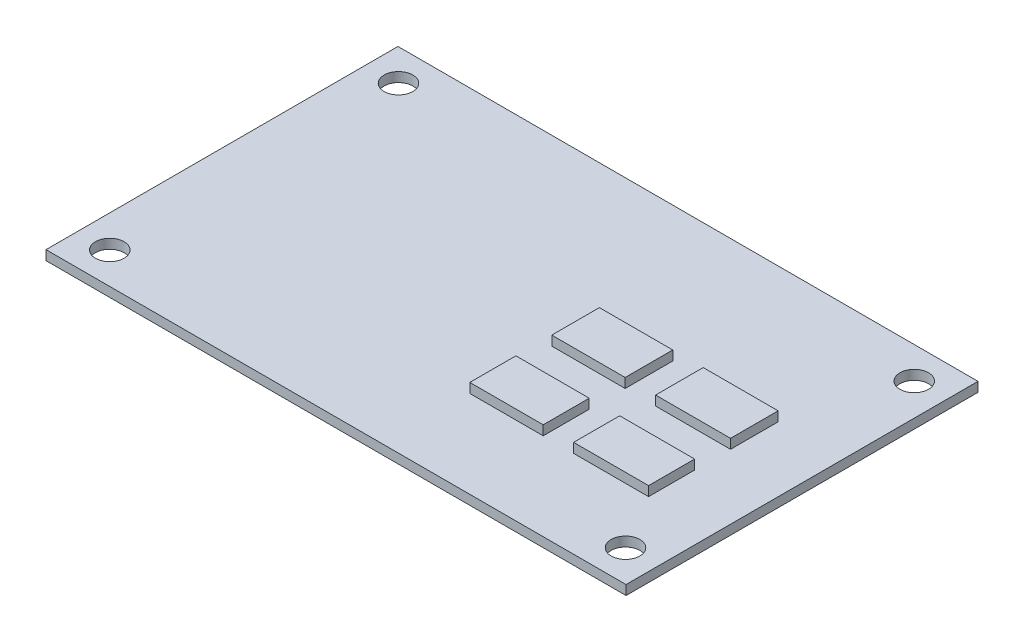
ISO-10303-21;
HEADER;
FILE_DESCRIPTION(('STEP AP214'),'2;1');
FILE_NAME('part.step','',(''),(''),'','','');
FILE_SCHEMA(('AUTOMOTIVE_DESIGN { 1 0 10303 214 1 1 1 1 }'));
ENDSEC;
DATA;
#1=APPLICATION_CONTEXT('core data for automotive mechanical design processes');
#2=APPLICATION_PROTOCOL_DEFINITION('international standard','automotive_design',2000,#1);
#3=PRODUCT_CONTEXT('',#1,'mechanical');
#4=PRODUCT('Part','Part','',(#3));
#5=PRODUCT_RELATED_PRODUCT_CATEGORY('part','',(#4));
#6=PRODUCT_DEFINITION_FORMATION('','',#4);
#7=PRODUCT_DEFINITION_CONTEXT('part definition',#1,'design');
#8=PRODUCT_DEFINITION('design','',#6,#7);
#9=PRODUCT_DEFINITION_SHAPE('','',#8);
#10=(LENGTH_UNIT() NAMED_UNIT(*) SI_UNIT(.MILLI.,.METRE.));
#11=(NAMED_UNIT(*) PLANE_ANGLE_UNIT() SI_UNIT($,.RADIAN.));
#12=(NAMED_UNIT(*) SI_UNIT($,.STERADIAN.) SOLID_ANGLE_UNIT());
#13=UNCERTAINTY_MEASURE_WITH_UNIT(LENGTH_MEASURE(1.E-05),#10,'distance_accuracy_value','');
#14=(GEOMETRIC_REPRESENTATION_CONTEXT(3) GLOBAL_UNCERTAINTY_ASSIGNED_CONTEXT((#13)) GLOBAL_UNIT_ASSIGNED_CONTEXT((#10,
#11,#12)) REPRESENTATION_CONTEXT('',''));
#15=CARTESIAN_POINT('',(0.,0.,0.));
#16=DIRECTION('',(0.,0.,1.));
#17=DIRECTION('',(1.,0.,0.));
#18=AXIS2_PLACEMENT_3D('',#15,#16,#17);
#19=CARTESIAN_POINT('',(0.,1.,0.));
#20=DIRECTION('',(0.,1.,0.));
#21=DIRECTION('',(0.,0.,1.));
#22=AXIS2_PLACEMENT_3D('',#19,#20,#21);
#23=PLANE('',#22);
#24=CARTESIAN_POINT('',(-27.,1.,-15.115));
#25=DIRECTION('',(0.,1.,0.));
#26=DIRECTION('',(0.,0.,1.));
#27=AXIS2_PLACEMENT_3D('',#24,#25,#26);
#28=CIRCLE('',#27,1.5);
#29=CARTESIAN_POINT('',(-27.,1.,-13.615));
#30=VERTEX_POINT('',#29);
#31=EDGE_CURVE('E289',#30,#30,#28,.T.);
#32=ORIENTED_EDGE('',*,*,#31,.F.);
#33=EDGE_LOOP('',(#32));
#34=FACE_BOUND('',#33,.T.);
#35=CARTESIAN_POINT('',(27.,1.,-15.115));
#36=DIRECTION('',(0.,1.,0.));
#37=DIRECTION('',(0.,0.,1.));
#38=AXIS2_PLACEMENT_3D('',#35,#36,#37);
#39=CIRCLE('',#38,1.5);
#40=CARTESIAN_POINT('',(27.,1.,-13.615));
#41=VERTEX_POINT('',#40);
#42=EDGE_CURVE('E292',#41,#41,#39,.T.);
#43=ORIENTED_EDGE('',*,*,#42,.F.);
#44=EDGE_LOOP('',(#43));
#45=FACE_BOUND('',#44,.T.);
#46=CARTESIAN_POINT('',(27.,1.,15.115));
#47=DIRECTION('',(0.,1.,0.));
#48=DIRECTION('',(0.,0.,1.));
#49=AXIS2_PLACEMENT_3D('',#46,#47,#48);
#50=CIRCLE('',#49,1.5);
#51=CARTESIAN_POINT('',(27.,1.,16.615));
#52=VERTEX_POINT('',#51);
#53=EDGE_CURVE('E298',#52,#52,#50,.T.);
#54=ORIENTED_EDGE('',*,*,#53,.F.);
#55=EDGE_LOOP('',(#54));
#56=FACE_BOUND('',#55,.T.);
#57=CARTESIAN_POINT('',(-27.,1.,15.115));
#58=DIRECTION('',(0.,1.,0.));
#59=DIRECTION('',(0.,0.,1.));
#60=AXIS2_PLACEMENT_3D('',#57,#58,#59);
#61=CIRCLE('',#60,1.5);
#62=CARTESIAN_POINT('',(-27.,1.,16.615));
#63=VERTEX_POINT('',#62);
#64=EDGE_CURVE('E302',#63,#63,#61,.T.);
#65=ORIENTED_EDGE('',*,*,#64,.F.);
#66=EDGE_LOOP('',(#65));
#67=FACE_BOUND('',#66,.T.);
#68=DIRECTION('',(0.,0.,-1.));
#69=VECTOR('',#68,1.);
#70=CARTESIAN_POINT('',(30.365,1.,-18.425));
#71=LINE('',#70,#69);
#72=CARTESIAN_POINT('',(30.365,1.,18.425));
#73=VERTEX_POINT('',#72);
#74=CARTESIAN_POINT('',(30.365,1.,-18.425));
#75=VERTEX_POINT('',#74);
#76=EDGE_CURVE('E309',#73,#75,#71,.T.);
#77=ORIENTED_EDGE('',*,*,#76,.T.);
#78=DIRECTION('',(-1.,0.,0.));
#79=VECTOR('',#78,1.);
#80=CARTESIAN_POINT('',(-30.365,1.,-18.425));
#81=LINE('',#80,#79);
#82=CARTESIAN_POINT('',(-30.365,1.,-18.425));
#83=VERTEX_POINT('',#82);
#84=EDGE_CURVE('E312',#75,#83,#81,.T.);
#85=ORIENTED_EDGE('',*,*,#84,.T.);
#86=DIRECTION('',(0.,0.,1.));
#87=VECTOR('',#86,1.);
#88=CARTESIAN_POINT('',(-30.365,1.,-18.425));
#89=LINE('',#88,#87);
#90=CARTESIAN_POINT('',(-30.365,1.,18.425));
#91=VERTEX_POINT('',#90);
#92=EDGE_CURVE('E315',#83,#91,#89,.T.);
#93=ORIENTED_EDGE('',*,*,#92,.T.);
#94=DIRECTION('',(1.,0.,0.));
#95=VECTOR('',#94,1.);
#96=CARTESIAN_POINT('',(-30.365,1.,18.425));
#97=LINE('',#96,#95);
#98=EDGE_CURVE('E317',#91,#73,#97,.T.);
#99=ORIENTED_EDGE('',*,*,#98,.T.);
#100=EDGE_LOOP('',(#77,#85,#93,#99));
#101=FACE_BOUND('',#100,.T.);
#102=DIRECTION('',(1.,0.,0.));
#103=VECTOR('',#102,1.);
#104=CARTESIAN_POINT('',(4.86128004171232,1.,0.69638328456207));
#105=LINE('',#104,#103);
#106=CARTESIAN_POINT('',(4.86128004171232,1.,0.69638328456207));
#107=VERTEX_POINT('',#106);
#108=CARTESIAN_POINT('',(12.5431113991219,1.,0.69638328456207));
#109=VERTEX_POINT('',#108);
#110=EDGE_CURVE('E274',#107,#109,#105,.T.);
#111=ORIENTED_EDGE('',*,*,#110,.F.);
#112=DIRECTION('',(0.,0.,1.));
#113=VECTOR('',#112,1.);
#114=CARTESIAN_POINT('',(4.86128004171232,1.,-4.28863493673567));
#115=LINE('',#114,#113);
#116=CARTESIAN_POINT('',(4.86128004171232,1.,-4.28863493673567));
#117=VERTEX_POINT('',#116);
#118=EDGE_CURVE('E260',#117,#107,#115,.T.);
#119=ORIENTED_EDGE('',*,*,#118,.F.);
#120=DIRECTION('',(-1.,0.,0.));
#121=VECTOR('',#120,1.);
#122=CARTESIAN_POINT('',(4.86128004171232,1.,-4.28863493673567));
#123=LINE('',#122,#121);
#124=CARTESIAN_POINT('',(12.5431113991219,1.,-4.28863493673567));
#125=VERTEX_POINT('',#124);
#126=EDGE_CURVE('E265',#125,#117,#123,.T.);
#127=ORIENTED_EDGE('',*,*,#126,.F.);
#128=DIRECTION('',(0.,0.,-1.));
#129=VECTOR('',#128,1.);
#130=CARTESIAN_POINT('',(12.5431113991219,1.,-4.28863493673567));
#131=LINE('',#130,#129);
#132=EDGE_CURVE('E276',#109,#125,#131,.T.);
#133=ORIENTED_EDGE('',*,*,#132,.F.);
#134=EDGE_LOOP('',(#111,#119,#127,#133));
#135=FACE_BOUND('',#134,.T.);
#136=DIRECTION('',(1.,0.,0.));
#137=VECTOR('',#136,1.);
#138=CARTESIAN_POINT('',(15.7302541963451,1.,0.69638328456207));
#139=LINE('',#138,#137);
#140=CARTESIAN_POINT('',(15.7302541963451,1.,0.69638328456207));
#141=VERTEX_POINT('',#140);
#142=CARTESIAN_POINT('',(23.5755287741251,1.,0.69638328456207));
#143=VERTEX_POINT('',#142);
#144=EDGE_CURVE('E245',#141,#143,#139,.T.);
#145=ORIENTED_EDGE('',*,*,#144,.F.);
#146=DIRECTION('',(0.,0.,1.));
#147=VECTOR('',#146,1.);
#148=CARTESIAN_POINT('',(15.7302541963451,1.,-4.28863493673567));
#149=LINE('',#148,#147);
#150=CARTESIAN_POINT('',(15.7302541963451,1.,-4.28863493673567));
#151=VERTEX_POINT('',#150);
#152=EDGE_CURVE('E231',#151,#141,#149,.T.);
#153=ORIENTED_EDGE('',*,*,#152,.F.);
#154=DIRECTION('',(-1.,0.,0.));
#155=VECTOR('',#154,1.);
#156=CARTESIAN_POINT('',(15.7302541963451,1.,-4.28863493673567));
#157=LINE('',#156,#155);
#158=CARTESIAN_POINT('',(23.5755287741251,1.,-4.28863493673567));
#159=VERTEX_POINT('',#158);
#160=EDGE_CURVE('E236',#159,#151,#157,.T.);
#161=ORIENTED_EDGE('',*,*,#160,.F.);
#162=DIRECTION('',(0.,0.,-1.));
#163=VECTOR('',#162,1.);
#164=CARTESIAN_POINT('',(23.5755287741251,1.,-4.28863493673567));
#165=LINE('',#164,#163);
#166=EDGE_CURVE('E247',#143,#159,#165,.T.);
#167=ORIENTED_EDGE('',*,*,#166,.F.);
#168=EDGE_LOOP('',(#145,#153,#161,#167));
#169=FACE_BOUND('',#168,.T.);
#170=DIRECTION('',(1.,0.,0.));
#171=VECTOR('',#170,1.);
#172=CARTESIAN_POINT('',(4.86128004171232,1.,9.27715235400899));
#173=LINE('',#172,#171);
#174=CARTESIAN_POINT('',(4.86128004171232,1.,9.27715235400899));
#175=VERTEX_POINT('',#174);
#176=CARTESIAN_POINT('',(12.5431113991219,1.,9.27715235400899));
#177=VERTEX_POINT('',#176);
#178=EDGE_CURVE('E203',#175,#177,#173,.T.);
#179=ORIENTED_EDGE('',*,*,#178,.F.);
#180=DIRECTION('',(0.,0.,1.));
#181=VECTOR('',#180,1.);
#182=CARTESIAN_POINT('',(4.86128004171232,1.,4.45557735308167));
#183=LINE('',#182,#181);
#184=CARTESIAN_POINT('',(4.86128004171232,1.,4.45557735308167));
#185=VERTEX_POINT('',#184);
#186=EDGE_CURVE('E200',#185,#175,#183,.T.);
#187=ORIENTED_EDGE('',*,*,#186,.F.);
#188=DIRECTION('',(-1.,0.,0.));
#189=VECTOR('',#188,1.);
#190=CARTESIAN_POINT('',(4.86128004171232,1.,4.45557735308167));
#191=LINE('',#190,#189);
#192=CARTESIAN_POINT('',(12.5431113991219,1.,4.45557735308167));
#193=VERTEX_POINT('',#192);
#194=EDGE_CURVE('E212',#193,#185,#191,.T.);
#195=ORIENTED_EDGE('',*,*,#194,.F.);
#196=DIRECTION('',(0.,0.,-1.));
#197=VECTOR('',#196,1.);
#198=CARTESIAN_POINT('',(12.5431113991219,1.,4.45557735308167));
#199=LINE('',#198,#197);
#200=EDGE_CURVE('E220',#177,#193,#199,.T.);
#201=ORIENTED_EDGE('',*,*,#200,.F.);
#202=EDGE_LOOP('',(#179,#187,#195,#201));
#203=FACE_BOUND('',#202,.T.);
#204=DIRECTION('',(1.,0.,0.));
#205=VECTOR('',#204,1.);
#206=CARTESIAN_POINT('',(15.7302541963451,1.,9.27715235400899));
#207=LINE('',#206,#205);
#208=CARTESIAN_POINT('',(15.7302541963451,1.,9.27715235400899));
#209=VERTEX_POINT('',#208);
#210=CARTESIAN_POINT('',(23.5755287741251,1.,9.27715235400899));
#211=VERTEX_POINT('',#210);
#212=EDGE_CURVE('E405',#209,#211,#207,.T.);
#213=ORIENTED_EDGE('',*,*,#212,.F.);
#214=DIRECTION('',(0.,0.,1.));
#215=VECTOR('',#214,1.);
#216=CARTESIAN_POINT('',(15.7302541963451,1.,4.45557735308167));
#217=LINE('',#216,#215);
#218=CARTESIAN_POINT('',(15.7302541963451,1.,4.45557735308167));
#219=VERTEX_POINT('',#218);
#220=EDGE_CURVE('E198',#219,#209,#217,.T.);
#221=ORIENTED_EDGE('',*,*,#220,.F.);
#222=DIRECTION('',(-1.,0.,0.));
#223=VECTOR('',#222,1.);
#224=CARTESIAN_POINT('',(15.7302541963451,1.,4.45557735308167));
#225=LINE('',#224,#223);
#226=CARTESIAN_POINT('',(23.5755287741251,1.,4.45557735308167));
#227=VERTEX_POINT('',#226);
#228=EDGE_CURVE('E194',#227,#219,#225,.T.);
#229=ORIENTED_EDGE('',*,*,#228,.F.);
#230=DIRECTION('',(0.,0.,-1.));
#231=VECTOR('',#230,1.);
#232=CARTESIAN_POINT('',(23.5755287741251,1.,4.45557735308167));
#233=LINE('',#232,#231);
#234=EDGE_CURVE('E407',#211,#227,#233,.T.);
#235=ORIENTED_EDGE('',*,*,#234,.F.);
#236=EDGE_LOOP('',(#213,#221,#229,#235));
#237=FACE_BOUND('',#236,.T.);
#238=ADVANCED_FACE('F35',(#34,#45,#56,#67,#101,#135,#169,#203,#237),#23,.T.);
#239=CARTESIAN_POINT('',(30.365,1.,-18.425));
#240=DIRECTION('',(-1.,0.,0.));
#241=DIRECTION('',(0.,0.,1.));
#242=AXIS2_PLACEMENT_3D('',#239,#240,#241);
#243=PLANE('',#242);
#244=DIRECTION('',(0.,0.,-1.));
#245=VECTOR('',#244,1.);
#246=CARTESIAN_POINT('',(30.365,0.,-18.425));
#247=LINE('',#246,#245);
#248=CARTESIAN_POINT('',(30.365,0.,18.425));
#249=VERTEX_POINT('',#248);
#250=CARTESIAN_POINT('',(30.365,0.,-18.425));
#251=VERTEX_POINT('',#250);
#252=EDGE_CURVE('E308',#249,#251,#247,.T.);
#253=ORIENTED_EDGE('',*,*,#252,.T.);
#254=DIRECTION('',(0.,-1.,0.));
#255=VECTOR('',#254,1.);
#256=CARTESIAN_POINT('',(30.365,1.,-18.425));
#257=LINE('',#256,#255);
#258=EDGE_CURVE('E11',#75,#251,#257,.T.);
#259=ORIENTED_EDGE('',*,*,#258,.F.);
#260=ORIENTED_EDGE('',*,*,#76,.F.);
#261=DIRECTION('',(0.,-1.,0.));
#262=VECTOR('',#261,1.);
#263=CARTESIAN_POINT('',(30.365,1.,18.425));
#264=LINE('',#263,#262);
#265=EDGE_CURVE('E319',#73,#249,#264,.T.);
#266=ORIENTED_EDGE('',*,*,#265,.T.);
#267=EDGE_LOOP('',(#253,#259,#260,#266));
#268=FACE_BOUND('',#267,.T.);
#269=ADVANCED_FACE('F37',(#268),#243,.F.);
#270=CARTESIAN_POINT('',(-30.365,1.,-18.425));
#271=DIRECTION('',(0.,0.,1.));
#272=DIRECTION('',(1.,0.,0.));
#273=AXIS2_PLACEMENT_3D('',#270,#271,#272);
#274=PLANE('',#273);
#275=DIRECTION('',(-1.,0.,0.));
#276=VECTOR('',#275,1.);
#277=CARTESIAN_POINT('',(-30.365,0.,-18.425));
#278=LINE('',#277,#276);
#279=CARTESIAN_POINT('',(-30.365,0.,-18.425));
#280=VERTEX_POINT('',#279);
#281=EDGE_CURVE('E322',#251,#280,#278,.T.);
#282=ORIENTED_EDGE('',*,*,#281,.T.);
#283=DIRECTION('',(0.,-1.,0.));
#284=VECTOR('',#283,1.);
#285=CARTESIAN_POINT('',(-30.365,1.,-18.425));
#286=LINE('',#285,#284);
#287=EDGE_CURVE('E44',#83,#280,#286,.T.);
#288=ORIENTED_EDGE('',*,*,#287,.F.);
#289=ORIENTED_EDGE('',*,*,#84,.F.);
#290=ORIENTED_EDGE('',*,*,#258,.T.);
#291=EDGE_LOOP('',(#282,#288,#289,#290));
#292=FACE_BOUND('',#291,.T.);
#293=ADVANCED_FACE('F360',(#292),#274,.F.);
#294=CARTESIAN_POINT('',(-30.365,1.,-18.425));
#295=DIRECTION('',(1.,0.,0.));
#296=DIRECTION('',(0.,0.,-1.));
#297=AXIS2_PLACEMENT_3D('',#294,#295,#296);
#298=PLANE('',#297);
#299=DIRECTION('',(0.,0.,1.));
#300=VECTOR('',#299,1.);
#301=CARTESIAN_POINT('',(-30.365,0.,-18.425));
#302=LINE('',#301,#300);
#303=CARTESIAN_POINT('',(-30.365,0.,18.425));
#304=VERTEX_POINT('',#303);
#305=EDGE_CURVE('E324',#280,#304,#302,.T.);
#306=ORIENTED_EDGE('',*,*,#305,.T.);
#307=DIRECTION('',(0.,-1.,0.));
#308=VECTOR('',#307,1.);
#309=CARTESIAN_POINT('',(-30.365,1.,18.425));
#310=LINE('',#309,#308);
#311=EDGE_CURVE('E329',#91,#304,#310,.T.);
#312=ORIENTED_EDGE('',*,*,#311,.F.);
#313=ORIENTED_EDGE('',*,*,#92,.F.);
#314=ORIENTED_EDGE('',*,*,#287,.T.);
#315=EDGE_LOOP('',(#306,#312,#313,#314));
#316=FACE_BOUND('',#315,.T.);
#317=ADVANCED_FACE('F371',(#316),#298,.F.);
#318=CARTESIAN_POINT('',(-30.365,1.,18.425));
#319=DIRECTION('',(0.,0.,-1.));
#320=DIRECTION('',(-1.,0.,0.));
#321=AXIS2_PLACEMENT_3D('',#318,#319,#320);
#322=PLANE('',#321);
#323=DIRECTION('',(1.,0.,0.));
#324=VECTOR('',#323,1.);
#325=CARTESIAN_POINT('',(-30.365,0.,18.425));
#326=LINE('',#325,#324);
#327=EDGE_CURVE('E313',#304,#249,#326,.T.);
#328=ORIENTED_EDGE('',*,*,#327,.T.);
#329=ORIENTED_EDGE('',*,*,#265,.F.);
#330=ORIENTED_EDGE('',*,*,#98,.F.);
#331=ORIENTED_EDGE('',*,*,#311,.T.);
#332=EDGE_LOOP('',(#328,#329,#330,#331));
#333=FACE_BOUND('',#332,.T.);
#334=ADVANCED_FACE('F367',(#333),#322,.F.);
#335=CARTESIAN_POINT('',(0.,0.,0.));
#336=DIRECTION('',(0.,1.,0.));
#337=DIRECTION('',(0.,0.,1.));
#338=AXIS2_PLACEMENT_3D('',#335,#336,#337);
#339=PLANE('',#338);
#340=CARTESIAN_POINT('',(-27.,0.,-15.115));
#341=DIRECTION('',(0.,1.,0.));
#342=DIRECTION('',(0.,0.,1.));
#343=AXIS2_PLACEMENT_3D('',#340,#341,#342);
#344=CIRCLE('',#343,1.5);
#345=CARTESIAN_POINT('',(-27.,0.,-13.615));
#346=VERTEX_POINT('',#345);
#347=EDGE_CURVE('E39',#346,#346,#344,.T.);
#348=ORIENTED_EDGE('',*,*,#347,.T.);
#349=EDGE_LOOP('',(#348));
#350=FACE_BOUND('',#349,.T.);
#351=CARTESIAN_POINT('',(27.,0.,-15.115));
#352=DIRECTION('',(0.,1.,0.));
#353=DIRECTION('',(0.,0.,1.));
#354=AXIS2_PLACEMENT_3D('',#351,#352,#353);
#355=CIRCLE('',#354,1.5);
#356=CARTESIAN_POINT('',(27.,0.,-13.615));
#357=VERTEX_POINT('',#356);
#358=EDGE_CURVE('E295',#357,#357,#355,.T.);
#359=ORIENTED_EDGE('',*,*,#358,.T.);
#360=EDGE_LOOP('',(#359));
#361=FACE_BOUND('',#360,.T.);
#362=CARTESIAN_POINT('',(27.,0.,15.115));
#363=DIRECTION('',(0.,1.,0.));
#364=DIRECTION('',(0.,0.,1.));
#365=AXIS2_PLACEMENT_3D('',#362,#363,#364);
#366=CIRCLE('',#365,1.5);
#367=CARTESIAN_POINT('',(27.,0.,16.615));
#368=VERTEX_POINT('',#367);
#369=EDGE_CURVE('E301',#368,#368,#366,.T.);
#370=ORIENTED_EDGE('',*,*,#369,.T.);
#371=EDGE_LOOP('',(#370));
#372=FACE_BOUND('',#371,.T.);
#373=CARTESIAN_POINT('',(-27.,0.,15.115));
#374=DIRECTION('',(0.,1.,0.));
#375=DIRECTION('',(0.,0.,1.));
#376=AXIS2_PLACEMENT_3D('',#373,#374,#375);
#377=CIRCLE('',#376,1.5);
#378=CARTESIAN_POINT('',(-27.,0.,16.615));
#379=VERTEX_POINT('',#378);
#380=EDGE_CURVE('E305',#379,#379,#377,.T.);
#381=ORIENTED_EDGE('',*,*,#380,.T.);
#382=EDGE_LOOP('',(#381));
#383=FACE_BOUND('',#382,.T.);
#384=ORIENTED_EDGE('',*,*,#252,.F.);
#385=ORIENTED_EDGE('',*,*,#327,.F.);
#386=ORIENTED_EDGE('',*,*,#305,.F.);
#387=ORIENTED_EDGE('',*,*,#281,.F.);
#388=EDGE_LOOP('',(#384,#385,#386,#387));
#389=FACE_BOUND('',#388,.T.);
#390=ADVANCED_FACE('F336',(#350,#361,#372,#383,#389),#339,.F.);
#391=CARTESIAN_POINT('',(-27.,1.,15.115));
#392=DIRECTION('',(0.,1.,0.));
#393=DIRECTION('',(0.,0.,1.));
#394=AXIS2_PLACEMENT_3D('',#391,#392,#393);
#395=CYLINDRICAL_SURFACE('',#394,1.5);
#396=ORIENTED_EDGE('',*,*,#64,.T.);
#397=EDGE_LOOP('',(#396));
#398=FACE_BOUND('',#397,.T.);
#399=ORIENTED_EDGE('',*,*,#380,.F.);
#400=EDGE_LOOP('',(#399));
#401=FACE_BOUND('',#400,.T.);
#402=ADVANCED_FACE('F342',(#398,#401),#395,.F.);
#403=CARTESIAN_POINT('',(27.,1.,15.115));
#404=DIRECTION('',(0.,1.,0.));
#405=DIRECTION('',(0.,0.,1.));
#406=AXIS2_PLACEMENT_3D('',#403,#404,#405);
#407=CYLINDRICAL_SURFACE('',#406,1.5);
#408=ORIENTED_EDGE('',*,*,#53,.T.);
#409=EDGE_LOOP('',(#408));
#410=FACE_BOUND('',#409,.T.);
#411=ORIENTED_EDGE('',*,*,#369,.F.);
#412=EDGE_LOOP('',(#411));
#413=FACE_BOUND('',#412,.T.);
#414=ADVANCED_FACE('F339',(#410,#413),#407,.F.);
#415=CARTESIAN_POINT('',(27.,1.,-15.115));
#416=DIRECTION('',(0.,1.,0.));
#417=DIRECTION('',(0.,0.,1.));
#418=AXIS2_PLACEMENT_3D('',#415,#416,#417);
#419=CYLINDRICAL_SURFACE('',#418,1.5);
#420=ORIENTED_EDGE('',*,*,#42,.T.);
#421=EDGE_LOOP('',(#420));
#422=FACE_BOUND('',#421,.T.);
#423=ORIENTED_EDGE('',*,*,#358,.F.);
#424=EDGE_LOOP('',(#423));
#425=FACE_BOUND('',#424,.T.);
#426=ADVANCED_FACE('F341',(#422,#425),#419,.F.);
#427=CARTESIAN_POINT('',(-27.,1.,-15.115));
#428=DIRECTION('',(0.,1.,0.));
#429=DIRECTION('',(0.,0.,1.));
#430=AXIS2_PLACEMENT_3D('',#427,#428,#429);
#431=CYLINDRICAL_SURFACE('',#430,1.5);
#432=ORIENTED_EDGE('',*,*,#31,.T.);
#433=EDGE_LOOP('',(#432));
#434=FACE_BOUND('',#433,.T.);
#435=ORIENTED_EDGE('',*,*,#347,.F.);
#436=EDGE_LOOP('',(#435));
#437=FACE_BOUND('',#436,.T.);
#438=ADVANCED_FACE('F349',(#434,#437),#431,.F.);
#439=CARTESIAN_POINT('',(4.86128004171232,2.,-4.28863493673567));
#440=DIRECTION('',(1.,0.,0.));
#441=DIRECTION('',(0.,0.,-1.));
#442=AXIS2_PLACEMENT_3D('',#439,#440,#441);
#443=PLANE('',#442);
#444=ORIENTED_EDGE('',*,*,#118,.T.);
#445=DIRECTION('',(0.,-1.,0.));
#446=VECTOR('',#445,1.);
#447=CARTESIAN_POINT('',(4.86128004171232,2.,0.69638328456207));
#448=LINE('',#447,#446);
#449=CARTESIAN_POINT('',(4.86128004171232,2.,0.69638328456207));
#450=VERTEX_POINT('',#449);
#451=EDGE_CURVE('E287',#450,#107,#448,.T.);
#452=ORIENTED_EDGE('',*,*,#451,.F.);
#453=DIRECTION('',(0.,0.,1.));
#454=VECTOR('',#453,1.);
#455=CARTESIAN_POINT('',(4.86128004171232,2.,-4.28863493673567));
#456=LINE('',#455,#454);
#457=CARTESIAN_POINT('',(4.86128004171232,2.,-4.28863493673567));
#458=VERTEX_POINT('',#457);
#459=EDGE_CURVE('E261',#458,#450,#456,.T.);
#460=ORIENTED_EDGE('',*,*,#459,.F.);
#461=DIRECTION('',(0.,-1.,0.));
#462=VECTOR('',#461,1.);
#463=CARTESIAN_POINT('',(4.86128004171232,2.,-4.28863493673567));
#464=LINE('',#463,#462);
#465=EDGE_CURVE('E271',#458,#117,#464,.T.);
#466=ORIENTED_EDGE('',*,*,#465,.T.);
#467=EDGE_LOOP('',(#444,#452,#460,#466));
#468=FACE_BOUND('',#467,.T.);
#469=ADVANCED_FACE('F486',(#468),#443,.F.);
#470=CARTESIAN_POINT('',(4.86128004171232,2.,0.69638328456207));
#471=DIRECTION('',(0.,0.,-1.));
#472=DIRECTION('',(-1.,0.,0.));
#473=AXIS2_PLACEMENT_3D('',#470,#471,#472);
#474=PLANE('',#473);
#475=ORIENTED_EDGE('',*,*,#110,.T.);
#476=DIRECTION('',(0.,-1.,0.));
#477=VECTOR('',#476,1.);
#478=CARTESIAN_POINT('',(12.5431113991219,2.,0.69638328456207));
#479=LINE('',#478,#477);
#480=CARTESIAN_POINT('',(12.5431113991219,2.,0.69638328456207));
#481=VERTEX_POINT('',#480);
#482=EDGE_CURVE('E284',#481,#109,#479,.T.);
#483=ORIENTED_EDGE('',*,*,#482,.F.);
#484=DIRECTION('',(1.,0.,0.));
#485=VECTOR('',#484,1.);
#486=CARTESIAN_POINT('',(4.86128004171232,2.,0.69638328456207));
#487=LINE('',#486,#485);
#488=EDGE_CURVE('E264',#450,#481,#487,.T.);
#489=ORIENTED_EDGE('',*,*,#488,.F.);
#490=ORIENTED_EDGE('',*,*,#451,.T.);
#491=EDGE_LOOP('',(#475,#483,#489,#490));
#492=FACE_BOUND('',#491,.T.);
#493=ADVANCED_FACE('F482',(#492),#474,.F.);
#494=CARTESIAN_POINT('',(12.5431113991219,2.,-4.28863493673567));
#495=DIRECTION('',(-1.,0.,0.));
#496=DIRECTION('',(0.,0.,1.));
#497=AXIS2_PLACEMENT_3D('',#494,#495,#496);
#498=PLANE('',#497);
#499=ORIENTED_EDGE('',*,*,#132,.T.);
#500=DIRECTION('',(0.,-1.,0.));
#501=VECTOR('',#500,1.);
#502=CARTESIAN_POINT('',(12.5431113991219,2.,-4.28863493673567));
#503=LINE('',#502,#501);
#504=CARTESIAN_POINT('',(12.5431113991219,2.,-4.28863493673567));
#505=VERTEX_POINT('',#504);
#506=EDGE_CURVE('E282',#505,#125,#503,.T.);
#507=ORIENTED_EDGE('',*,*,#506,.F.);
#508=DIRECTION('',(0.,0.,-1.));
#509=VECTOR('',#508,1.);
#510=CARTESIAN_POINT('',(12.5431113991219,2.,-4.28863493673567));
#511=LINE('',#510,#509);
#512=EDGE_CURVE('E267',#481,#505,#511,.T.);
#513=ORIENTED_EDGE('',*,*,#512,.F.);
#514=ORIENTED_EDGE('',*,*,#482,.T.);
#515=EDGE_LOOP('',(#499,#507,#513,#514));
#516=FACE_BOUND('',#515,.T.);
#517=ADVANCED_FACE('F478',(#516),#498,.F.);
#518=CARTESIAN_POINT('',(4.86128004171232,2.,-4.28863493673567));
#519=DIRECTION('',(0.,0.,1.));
#520=DIRECTION('',(1.,0.,0.));
#521=AXIS2_PLACEMENT_3D('',#518,#519,#520);
#522=PLANE('',#521);
#523=ORIENTED_EDGE('',*,*,#126,.T.);
#524=ORIENTED_EDGE('',*,*,#465,.F.);
#525=DIRECTION('',(-1.,0.,0.));
#526=VECTOR('',#525,1.);
#527=CARTESIAN_POINT('',(4.86128004171232,2.,-4.28863493673567));
#528=LINE('',#527,#526);
#529=EDGE_CURVE('E269',#505,#458,#528,.T.);
#530=ORIENTED_EDGE('',*,*,#529,.F.);
#531=ORIENTED_EDGE('',*,*,#506,.T.);
#532=EDGE_LOOP('',(#523,#524,#530,#531));
#533=FACE_BOUND('',#532,.T.);
#534=ADVANCED_FACE('F474',(#533),#522,.F.);
#535=CARTESIAN_POINT('',(0.,2.,0.));
#536=DIRECTION('',(0.,1.,0.));
#537=DIRECTION('',(0.,0.,1.));
#538=AXIS2_PLACEMENT_3D('',#535,#536,#537);
#539=PLANE('',#538);
#540=ORIENTED_EDGE('',*,*,#459,.T.);
#541=ORIENTED_EDGE('',*,*,#488,.T.);
#542=ORIENTED_EDGE('',*,*,#512,.T.);
#543=ORIENTED_EDGE('',*,*,#529,.T.);
#544=EDGE_LOOP('',(#540,#541,#542,#543));
#545=FACE_BOUND('',#544,.T.);
#546=ADVANCED_FACE('F470',(#545),#539,.T.);
#547=CARTESIAN_POINT('',(15.7302541963451,2.,-4.28863493673567));
#548=DIRECTION('',(1.,0.,0.));
#549=DIRECTION('',(0.,0.,-1.));
#550=AXIS2_PLACEMENT_3D('',#547,#548,#549);
#551=PLANE('',#550);
#552=ORIENTED_EDGE('',*,*,#152,.T.);
#553=DIRECTION('',(0.,-1.,0.));
#554=VECTOR('',#553,1.);
#555=CARTESIAN_POINT('',(15.7302541963451,2.,0.69638328456207));
#556=LINE('',#555,#554);
#557=CARTESIAN_POINT('',(15.7302541963451,2.,0.69638328456207));
#558=VERTEX_POINT('',#557);
#559=EDGE_CURVE('E258',#558,#141,#556,.T.);
#560=ORIENTED_EDGE('',*,*,#559,.F.);
#561=DIRECTION('',(0.,0.,1.));
#562=VECTOR('',#561,1.);
#563=CARTESIAN_POINT('',(15.7302541963451,2.,-4.28863493673567));
#564=LINE('',#563,#562);
#565=CARTESIAN_POINT('',(15.7302541963451,2.,-4.28863493673567));
#566=VERTEX_POINT('',#565);
#567=EDGE_CURVE('E232',#566,#558,#564,.T.);
#568=ORIENTED_EDGE('',*,*,#567,.F.);
#569=DIRECTION('',(0.,-1.,0.));
#570=VECTOR('',#569,1.);
#571=CARTESIAN_POINT('',(15.7302541963451,2.,-4.28863493673567));
#572=LINE('',#571,#570);
#573=EDGE_CURVE('E242',#566,#151,#572,.T.);
#574=ORIENTED_EDGE('',*,*,#573,.T.);
#575=EDGE_LOOP('',(#552,#560,#568,#574));
#576=FACE_BOUND('',#575,.T.);
#577=ADVANCED_FACE('F466',(#576),#551,.F.);
#578=CARTESIAN_POINT('',(15.7302541963451,2.,0.69638328456207));
#579=DIRECTION('',(0.,0.,-1.));
#580=DIRECTION('',(-1.,0.,0.));
#581=AXIS2_PLACEMENT_3D('',#578,#579,#580);
#582=PLANE('',#581);
#583=ORIENTED_EDGE('',*,*,#144,.T.);
#584=DIRECTION('',(0.,-1.,0.));
#585=VECTOR('',#584,1.);
#586=CARTESIAN_POINT('',(23.5755287741251,2.,0.69638328456207));
#587=LINE('',#586,#585);
#588=CARTESIAN_POINT('',(23.5755287741251,2.,0.69638328456207));
#589=VERTEX_POINT('',#588);
#590=EDGE_CURVE('E255',#589,#143,#587,.T.);
#591=ORIENTED_EDGE('',*,*,#590,.F.);
#592=DIRECTION('',(1.,0.,0.));
#593=VECTOR('',#592,1.);
#594=CARTESIAN_POINT('',(15.7302541963451,2.,0.69638328456207));
#595=LINE('',#594,#593);
#596=EDGE_CURVE('E235',#558,#589,#595,.T.);
#597=ORIENTED_EDGE('',*,*,#596,.F.);
#598=ORIENTED_EDGE('',*,*,#559,.T.);
#599=EDGE_LOOP('',(#583,#591,#597,#598));
#600=FACE_BOUND('',#599,.T.);
#601=ADVANCED_FACE('F462',(#600),#582,.F.);
#602=CARTESIAN_POINT('',(23.5755287741251,2.,-4.28863493673567));
#603=DIRECTION('',(-1.,0.,0.));
#604=DIRECTION('',(0.,0.,1.));
#605=AXIS2_PLACEMENT_3D('',#602,#603,#604);
#606=PLANE('',#605);
#607=ORIENTED_EDGE('',*,*,#166,.T.);
#608=DIRECTION('',(0.,-1.,0.));
#609=VECTOR('',#608,1.);
#610=CARTESIAN_POINT('',(23.5755287741251,2.,-4.28863493673567));
#611=LINE('',#610,#609);
#612=CARTESIAN_POINT('',(23.5755287741251,2.,-4.28863493673567));
#613=VERTEX_POINT('',#612);
#614=EDGE_CURVE('E253',#613,#159,#611,.T.);
#615=ORIENTED_EDGE('',*,*,#614,.F.);
#616=DIRECTION('',(0.,0.,-1.));
#617=VECTOR('',#616,1.);
#618=CARTESIAN_POINT('',(23.5755287741251,2.,-4.28863493673567));
#619=LINE('',#618,#617);
#620=EDGE_CURVE('E238',#589,#613,#619,.T.);
#621=ORIENTED_EDGE('',*,*,#620,.F.);
#622=ORIENTED_EDGE('',*,*,#590,.T.);
#623=EDGE_LOOP('',(#607,#615,#621,#622));
#624=FACE_BOUND('',#623,.T.);
#625=ADVANCED_FACE('F458',(#624),#606,.F.);
#626=CARTESIAN_POINT('',(15.7302541963451,2.,-4.28863493673567));
#627=DIRECTION('',(0.,0.,1.));
#628=DIRECTION('',(1.,0.,0.));
#629=AXIS2_PLACEMENT_3D('',#626,#627,#628);
#630=PLANE('',#629);
#631=ORIENTED_EDGE('',*,*,#160,.T.);
#632=ORIENTED_EDGE('',*,*,#573,.F.);
#633=DIRECTION('',(-1.,0.,0.));
#634=VECTOR('',#633,1.);
#635=CARTESIAN_POINT('',(15.7302541963451,2.,-4.28863493673567));
#636=LINE('',#635,#634);
#637=EDGE_CURVE('E240',#613,#566,#636,.T.);
#638=ORIENTED_EDGE('',*,*,#637,.F.);
#639=ORIENTED_EDGE('',*,*,#614,.T.);
#640=EDGE_LOOP('',(#631,#632,#638,#639));
#641=FACE_BOUND('',#640,.T.);
#642=ADVANCED_FACE('F454',(#641),#630,.F.);
#643=CARTESIAN_POINT('',(0.,2.,0.));
#644=DIRECTION('',(0.,1.,0.));
#645=DIRECTION('',(0.,0.,1.));
#646=AXIS2_PLACEMENT_3D('',#643,#644,#645);
#647=PLANE('',#646);
#648=ORIENTED_EDGE('',*,*,#567,.T.);
#649=ORIENTED_EDGE('',*,*,#596,.T.);
#650=ORIENTED_EDGE('',*,*,#620,.T.);
#651=ORIENTED_EDGE('',*,*,#637,.T.);
#652=EDGE_LOOP('',(#648,#649,#650,#651));
#653=FACE_BOUND('',#652,.T.);
#654=ADVANCED_FACE('F450',(#653),#647,.T.);
#655=CARTESIAN_POINT('',(4.86128004171232,2.,4.45557735308167));
#656=DIRECTION('',(1.,0.,0.));
#657=DIRECTION('',(0.,0.,-1.));
#658=AXIS2_PLACEMENT_3D('',#655,#656,#657);
#659=PLANE('',#658);
#660=ORIENTED_EDGE('',*,*,#186,.T.);
#661=DIRECTION('',(0.,-1.,0.));
#662=VECTOR('',#661,1.);
#663=CARTESIAN_POINT('',(4.86128004171232,2.,9.27715235400899));
#664=LINE('',#663,#662);
#665=CARTESIAN_POINT('',(4.86128004171232,2.,9.27715235400899));
#666=VERTEX_POINT('',#665);
#667=EDGE_CURVE('E229',#666,#175,#664,.T.);
#668=ORIENTED_EDGE('',*,*,#667,.F.);
#669=DIRECTION('',(0.,0.,1.));
#670=VECTOR('',#669,1.);
#671=CARTESIAN_POINT('',(4.86128004171232,2.,4.45557735308167));
#672=LINE('',#671,#670);
#673=CARTESIAN_POINT('',(4.86128004171232,2.,4.45557735308167));
#674=VERTEX_POINT('',#673);
#675=EDGE_CURVE('E208',#674,#666,#672,.T.);
#676=ORIENTED_EDGE('',*,*,#675,.F.);
#677=DIRECTION('',(0.,-1.,0.));
#678=VECTOR('',#677,1.);
#679=CARTESIAN_POINT('',(4.86128004171232,2.,4.45557735308167));
#680=LINE('',#679,#678);
#681=EDGE_CURVE('E217',#674,#185,#680,.T.);
#682=ORIENTED_EDGE('',*,*,#681,.T.);
#683=EDGE_LOOP('',(#660,#668,#676,#682));
#684=FACE_BOUND('',#683,.T.);
#685=ADVANCED_FACE('F446',(#684),#659,.F.);
#686=CARTESIAN_POINT('',(4.86128004171232,2.,9.27715235400899));
#687=DIRECTION('',(0.,0.,-1.));
#688=DIRECTION('',(-1.,0.,0.));
#689=AXIS2_PLACEMENT_3D('',#686,#687,#688);
#690=PLANE('',#689);
#691=ORIENTED_EDGE('',*,*,#178,.T.);
#692=DIRECTION('',(0.,-1.,0.));
#693=VECTOR('',#692,1.);
#694=CARTESIAN_POINT('',(12.5431113991219,2.,9.27715235400899));
#695=LINE('',#694,#693);
#696=CARTESIAN_POINT('',(12.5431113991219,2.,9.27715235400899));
#697=VERTEX_POINT('',#696);
#698=EDGE_CURVE('E226',#697,#177,#695,.T.);
#699=ORIENTED_EDGE('',*,*,#698,.F.);
#700=DIRECTION('',(1.,0.,0.));
#701=VECTOR('',#700,1.);
#702=CARTESIAN_POINT('',(4.86128004171232,2.,9.27715235400899));
#703=LINE('',#702,#701);
#704=EDGE_CURVE('E211',#666,#697,#703,.T.);
#705=ORIENTED_EDGE('',*,*,#704,.F.);
#706=ORIENTED_EDGE('',*,*,#667,.T.);
#707=EDGE_LOOP('',(#691,#699,#705,#706));
#708=FACE_BOUND('',#707,.T.);
#709=ADVANCED_FACE('F442',(#708),#690,.F.);
#710=CARTESIAN_POINT('',(12.5431113991219,2.,4.45557735308167));
#711=DIRECTION('',(-1.,0.,0.));
#712=DIRECTION('',(0.,0.,1.));
#713=AXIS2_PLACEMENT_3D('',#710,#711,#712);
#714=PLANE('',#713);
#715=ORIENTED_EDGE('',*,*,#200,.T.);
#716=DIRECTION('',(0.,-1.,0.));
#717=VECTOR('',#716,1.);
#718=CARTESIAN_POINT('',(12.5431113991219,2.,4.45557735308167));
#719=LINE('',#718,#717);
#720=CARTESIAN_POINT('',(12.5431113991219,2.,4.45557735308167));
#721=VERTEX_POINT('',#720);
#722=EDGE_CURVE('E60',#721,#193,#719,.T.);
#723=ORIENTED_EDGE('',*,*,#722,.F.);
#724=DIRECTION('',(0.,0.,-1.));
#725=VECTOR('',#724,1.);
#726=CARTESIAN_POINT('',(12.5431113991219,2.,4.45557735308167));
#727=LINE('',#726,#725);
#728=EDGE_CURVE('E214',#697,#721,#727,.T.);
#729=ORIENTED_EDGE('',*,*,#728,.F.);
#730=ORIENTED_EDGE('',*,*,#698,.T.);
#731=EDGE_LOOP('',(#715,#723,#729,#730));
#732=FACE_BOUND('',#731,.T.);
#733=ADVANCED_FACE('F439',(#732),#714,.F.);
#734=CARTESIAN_POINT('',(4.86128004171232,2.,4.45557735308167));
#735=DIRECTION('',(0.,0.,1.));
#736=DIRECTION('',(1.,0.,0.));
#737=AXIS2_PLACEMENT_3D('',#734,#735,#736);
#738=PLANE('',#737);
#739=ORIENTED_EDGE('',*,*,#194,.T.);
#740=ORIENTED_EDGE('',*,*,#681,.F.);
#741=DIRECTION('',(-1.,0.,0.));
#742=VECTOR('',#741,1.);
#743=CARTESIAN_POINT('',(4.86128004171232,2.,4.45557735308167));
#744=LINE('',#743,#742);
#745=EDGE_CURVE('E216',#721,#674,#744,.T.);
#746=ORIENTED_EDGE('',*,*,#745,.F.);
#747=ORIENTED_EDGE('',*,*,#722,.T.);
#748=EDGE_LOOP('',(#739,#740,#746,#747));
#749=FACE_BOUND('',#748,.T.);
#750=ADVANCED_FACE('F435',(#749),#738,.F.);
#751=CARTESIAN_POINT('',(0.,2.,0.));
#752=DIRECTION('',(0.,1.,0.));
#753=DIRECTION('',(0.,0.,1.));
#754=AXIS2_PLACEMENT_3D('',#751,#752,#753);
#755=PLANE('',#754);
#756=ORIENTED_EDGE('',*,*,#675,.T.);
#757=ORIENTED_EDGE('',*,*,#704,.T.);
#758=ORIENTED_EDGE('',*,*,#728,.T.);
#759=ORIENTED_EDGE('',*,*,#745,.T.);
#760=EDGE_LOOP('',(#756,#757,#758,#759));
#761=FACE_BOUND('',#760,.T.);
#762=ADVANCED_FACE('F432',(#761),#755,.T.);
#763=CARTESIAN_POINT('',(15.7302541963451,2.,4.45557735308167));
#764=DIRECTION('',(1.,0.,0.));
#765=DIRECTION('',(0.,0.,-1.));
#766=AXIS2_PLACEMENT_3D('',#763,#764,#765);
#767=PLANE('',#766);
#768=ORIENTED_EDGE('',*,*,#220,.T.);
#769=DIRECTION('',(0.,-1.,0.));
#770=VECTOR('',#769,1.);
#771=CARTESIAN_POINT('',(15.7302541963451,2.,9.27715235400899));
#772=LINE('',#771,#770);
#773=CARTESIAN_POINT('',(15.7302541963451,2.,9.27715235400899));
#774=VERTEX_POINT('',#773);
#775=EDGE_CURVE('E179',#774,#209,#772,.T.);
#776=ORIENTED_EDGE('',*,*,#775,.F.);
#777=DIRECTION('',(0.,0.,1.));
#778=VECTOR('',#777,1.);
#779=CARTESIAN_POINT('',(15.7302541963451,2.,4.45557735308167));
#780=LINE('',#779,#778);
#781=CARTESIAN_POINT('',(15.7302541963451,2.,4.45557735308167));
#782=VERTEX_POINT('',#781);
#783=EDGE_CURVE('E186',#782,#774,#780,.T.);
#784=ORIENTED_EDGE('',*,*,#783,.F.);
#785=DIRECTION('',(0.,-1.,0.));
#786=VECTOR('',#785,1.);
#787=CARTESIAN_POINT('',(15.7302541963451,2.,4.45557735308167));
#788=LINE('',#787,#786);
#789=EDGE_CURVE('E414',#782,#219,#788,.T.);
#790=ORIENTED_EDGE('',*,*,#789,.T.);
#791=EDGE_LOOP('',(#768,#776,#784,#790));
#792=FACE_BOUND('',#791,.T.);
#793=ADVANCED_FACE('F196',(#792),#767,.F.);
#794=CARTESIAN_POINT('',(15.7302541963451,2.,9.27715235400899));
#795=DIRECTION('',(0.,0.,-1.));
#796=DIRECTION('',(-1.,0.,0.));
#797=AXIS2_PLACEMENT_3D('',#794,#795,#796);
#798=PLANE('',#797);
#799=ORIENTED_EDGE('',*,*,#212,.T.);
#800=DIRECTION('',(0.,-1.,0.));
#801=VECTOR('',#800,1.);
#802=CARTESIAN_POINT('',(23.5755287741251,2.,9.27715235400899));
#803=LINE('',#802,#801);
#804=CARTESIAN_POINT('',(23.5755287741251,2.,9.27715235400899));
#805=VERTEX_POINT('',#804);
#806=EDGE_CURVE('E182',#805,#211,#803,.T.);
#807=ORIENTED_EDGE('',*,*,#806,.F.);
#808=DIRECTION('',(1.,0.,0.));
#809=VECTOR('',#808,1.);
#810=CARTESIAN_POINT('',(15.7302541963451,2.,9.27715235400899));
#811=LINE('',#810,#809);
#812=EDGE_CURVE('E175',#774,#805,#811,.T.);
#813=ORIENTED_EDGE('',*,*,#812,.F.);
#814=ORIENTED_EDGE('',*,*,#775,.T.);
#815=EDGE_LOOP('',(#799,#807,#813,#814));
#816=FACE_BOUND('',#815,.T.);
#817=ADVANCED_FACE('F177',(#816),#798,.F.);
#818=CARTESIAN_POINT('',(23.5755287741251,2.,4.45557735308167));
#819=DIRECTION('',(-1.,0.,0.));
#820=DIRECTION('',(0.,0.,1.));
#821=AXIS2_PLACEMENT_3D('',#818,#819,#820);
#822=PLANE('',#821);
#823=ORIENTED_EDGE('',*,*,#234,.T.);
#824=DIRECTION('',(0.,-1.,0.));
#825=VECTOR('',#824,1.);
#826=CARTESIAN_POINT('',(23.5755287741251,2.,4.45557735308167));
#827=LINE('',#826,#825);
#828=CARTESIAN_POINT('',(23.5755287741251,2.,4.45557735308167));
#829=VERTEX_POINT('',#828);
#830=EDGE_CURVE('E52',#829,#227,#827,.T.);
#831=ORIENTED_EDGE('',*,*,#830,.F.);
#832=DIRECTION('',(0.,0.,-1.));
#833=VECTOR('',#832,1.);
#834=CARTESIAN_POINT('',(23.5755287741251,2.,4.45557735308167));
#835=LINE('',#834,#833);
#836=EDGE_CURVE('E185',#805,#829,#835,.T.);
#837=ORIENTED_EDGE('',*,*,#836,.F.);
#838=ORIENTED_EDGE('',*,*,#806,.T.);
#839=EDGE_LOOP('',(#823,#831,#837,#838));
#840=FACE_BOUND('',#839,.T.);
#841=ADVANCED_FACE('F417',(#840),#822,.F.);
#842=CARTESIAN_POINT('',(15.7302541963451,2.,4.45557735308167));
#843=DIRECTION('',(0.,0.,1.));
#844=DIRECTION('',(1.,0.,0.));
#845=AXIS2_PLACEMENT_3D('',#842,#843,#844);
#846=PLANE('',#845);
#847=ORIENTED_EDGE('',*,*,#228,.T.);
#848=ORIENTED_EDGE('',*,*,#789,.F.);
#849=DIRECTION('',(-1.,0.,0.));
#850=VECTOR('',#849,1.);
#851=CARTESIAN_POINT('',(15.7302541963451,2.,4.45557735308167));
#852=LINE('',#851,#850);
#853=EDGE_CURVE('E190',#829,#782,#852,.T.);
#854=ORIENTED_EDGE('',*,*,#853,.F.);
#855=ORIENTED_EDGE('',*,*,#830,.T.);
#856=EDGE_LOOP('',(#847,#848,#854,#855));
#857=FACE_BOUND('',#856,.T.);
#858=ADVANCED_FACE('F418',(#857),#846,.F.);
#859=CARTESIAN_POINT('',(0.,2.,0.));
#860=DIRECTION('',(0.,1.,0.));
#861=DIRECTION('',(0.,0.,1.));
#862=AXIS2_PLACEMENT_3D('',#859,#860,#861);
#863=PLANE('',#862);
#864=ORIENTED_EDGE('',*,*,#783,.T.);
#865=ORIENTED_EDGE('',*,*,#812,.T.);
#866=ORIENTED_EDGE('',*,*,#836,.T.);
#867=ORIENTED_EDGE('',*,*,#853,.T.);
#868=EDGE_LOOP('',(#864,#865,#866,#867));
#869=FACE_BOUND('',#868,.T.);
#870=ADVANCED_FACE('F189',(#869),#863,.T.);
#871=CLOSED_SHELL('',(#238,#269,#293,#317,#334,#390,#402,#414,#426,#438,#469,#493,#517,#534,
#546,#577,#601,#625,#642,#654,#685,#709,#733,#750,#762,#793,#817,#841,#858,#870));
#872=MANIFOLD_SOLID_BREP('B2',#871);
#873=ADVANCED_BREP_SHAPE_REPRESENTATION('',(#18,#872),#14);
#874=SHAPE_DEFINITION_REPRESENTATION(#9,#873);
ENDSEC;
END-ISO-10303-21;
